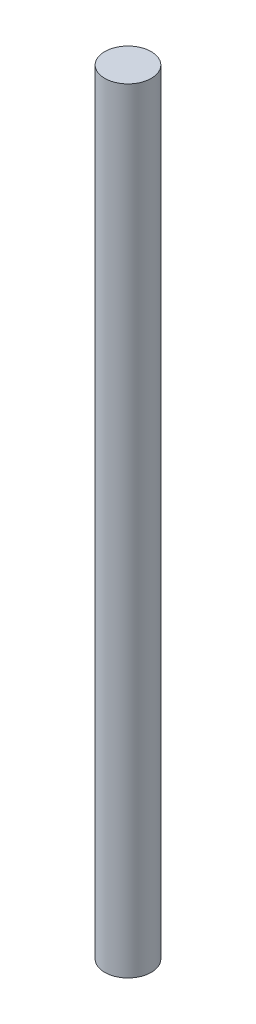
ISO-10303-21;
HEADER;
FILE_DESCRIPTION(('STEP AP214'),'2;1');
FILE_NAME('part.step','',(''),(''),'','','');
FILE_SCHEMA(('AUTOMOTIVE_DESIGN { 1 0 10303 214 1 1 1 1 }'));
ENDSEC;
DATA;
#1=APPLICATION_CONTEXT('core data for automotive mechanical design processes');
#2=APPLICATION_PROTOCOL_DEFINITION('international standard','automotive_design',2000,#1);
#3=PRODUCT_CONTEXT('',#1,'mechanical');
#4=PRODUCT('Part','Part','',(#3));
#5=PRODUCT_RELATED_PRODUCT_CATEGORY('part','',(#4));
#6=PRODUCT_DEFINITION_FORMATION('','',#4);
#7=PRODUCT_DEFINITION_CONTEXT('part definition',#1,'design');
#8=PRODUCT_DEFINITION('design','',#6,#7);
#9=PRODUCT_DEFINITION_SHAPE('','',#8);
#10=(LENGTH_UNIT() NAMED_UNIT(*) SI_UNIT(.MILLI.,.METRE.));
#11=(NAMED_UNIT(*) PLANE_ANGLE_UNIT() SI_UNIT($,.RADIAN.));
#12=(NAMED_UNIT(*) SI_UNIT($,.STERADIAN.) SOLID_ANGLE_UNIT());
#13=UNCERTAINTY_MEASURE_WITH_UNIT(LENGTH_MEASURE(1.E-05),#10,'distance_accuracy_value','');
#14=(GEOMETRIC_REPRESENTATION_CONTEXT(3) GLOBAL_UNCERTAINTY_ASSIGNED_CONTEXT((#13)) GLOBAL_UNIT_ASSIGNED_CONTEXT((#10,
#11,#12)) REPRESENTATION_CONTEXT('',''));
#15=CARTESIAN_POINT('',(0.,0.,0.));
#16=DIRECTION('',(0.,0.,1.));
#17=DIRECTION('',(1.,0.,0.));
#18=AXIS2_PLACEMENT_3D('',#15,#16,#17);
#19=CARTESIAN_POINT('',(0.,1000.,0.));
#20=DIRECTION('',(0.,-1.,0.));
#21=DIRECTION('',(0.,0.,-1.));
#22=AXIS2_PLACEMENT_3D('',#19,#20,#21);
#23=CYLINDRICAL_SURFACE('',#22,30.);
#24=CARTESIAN_POINT('',(0.,1000.,0.));
#25=DIRECTION('',(0.,1.,0.));
#26=DIRECTION('',(0.,0.,1.));
#27=AXIS2_PLACEMENT_3D('',#24,#25,#26);
#28=CIRCLE('',#27,30.);
#29=CARTESIAN_POINT('',(0.,1000.,30.));
#30=VERTEX_POINT('',#29);
#31=EDGE_CURVE('E10',#30,#30,#28,.T.);
#32=ORIENTED_EDGE('',*,*,#31,.F.);
#33=EDGE_LOOP('',(#32));
#34=FACE_BOUND('',#33,.T.);
#35=CARTESIAN_POINT('',(0.,0.,0.));
#36=DIRECTION('',(0.,1.,0.));
#37=DIRECTION('',(0.,0.,1.));
#38=AXIS2_PLACEMENT_3D('',#35,#36,#37);
#39=CIRCLE('',#38,30.);
#40=CARTESIAN_POINT('',(0.,0.,30.));
#41=VERTEX_POINT('',#40);
#42=EDGE_CURVE('E44',#41,#41,#39,.T.);
#43=ORIENTED_EDGE('',*,*,#42,.T.);
#44=EDGE_LOOP('',(#43));
#45=FACE_BOUND('',#44,.T.);
#46=ADVANCED_FACE('F41',(#34,#45),#23,.T.);
#47=CARTESIAN_POINT('',(0.,1000.,0.));
#48=DIRECTION('',(0.,1.,0.));
#49=DIRECTION('',(0.,0.,1.));
#50=AXIS2_PLACEMENT_3D('',#47,#48,#49);
#51=PLANE('',#50);
#52=ORIENTED_EDGE('',*,*,#31,.T.);
#53=EDGE_LOOP('',(#52));
#54=FACE_BOUND('',#53,.T.);
#55=ADVANCED_FACE('F58',(#54),#51,.T.);
#56=CARTESIAN_POINT('',(0.,0.,0.));
#57=DIRECTION('',(0.,1.,0.));
#58=DIRECTION('',(0.,0.,1.));
#59=AXIS2_PLACEMENT_3D('',#56,#57,#58);
#60=PLANE('',#59);
#61=ORIENTED_EDGE('',*,*,#42,.F.);
#62=EDGE_LOOP('',(#61));
#63=FACE_BOUND('',#62,.T.);
#64=ADVANCED_FACE('F56',(#63),#60,.F.);
#65=CLOSED_SHELL('',(#46,#55,#64));
#66=MANIFOLD_SOLID_BREP('B2',#65);
#67=ADVANCED_BREP_SHAPE_REPRESENTATION('',(#18,#66),#14);
#68=SHAPE_DEFINITION_REPRESENTATION(#9,#67);
ENDSEC;
END-ISO-10303-21;
